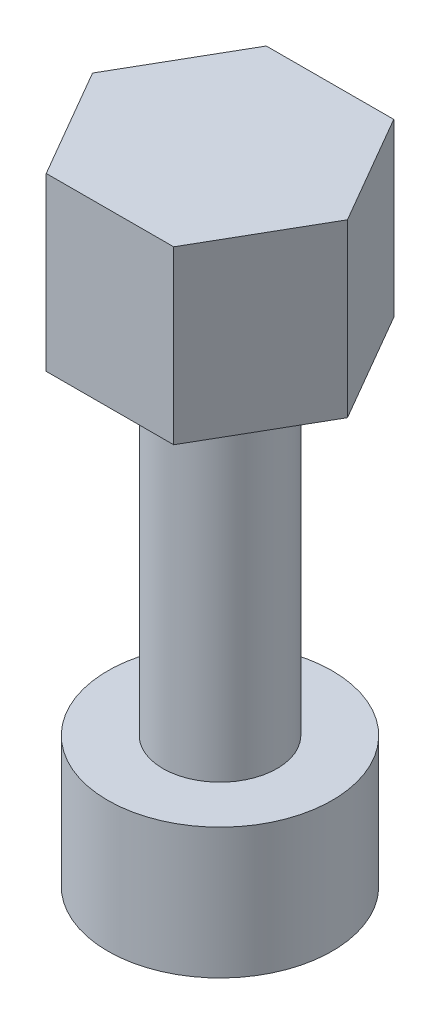
ISO-10303-21;
HEADER;
FILE_DESCRIPTION(('STEP AP214'),'2;1');
FILE_NAME('part.step','',(''),(''),'','','');
FILE_SCHEMA(('AUTOMOTIVE_DESIGN { 1 0 10303 214 1 1 1 1 }'));
ENDSEC;
DATA;
#1=APPLICATION_CONTEXT('core data for automotive mechanical design processes');
#2=APPLICATION_PROTOCOL_DEFINITION('international standard','automotive_design',2000,#1);
#3=PRODUCT_CONTEXT('',#1,'mechanical');
#4=PRODUCT('Part','Part','',(#3));
#5=PRODUCT_RELATED_PRODUCT_CATEGORY('part','',(#4));
#6=PRODUCT_DEFINITION_FORMATION('','',#4);
#7=PRODUCT_DEFINITION_CONTEXT('part definition',#1,'design');
#8=PRODUCT_DEFINITION('design','',#6,#7);
#9=PRODUCT_DEFINITION_SHAPE('','',#8);
#10=(LENGTH_UNIT() NAMED_UNIT(*) SI_UNIT(.MILLI.,.METRE.));
#11=(NAMED_UNIT(*) PLANE_ANGLE_UNIT() SI_UNIT($,.RADIAN.));
#12=(NAMED_UNIT(*) SI_UNIT($,.STERADIAN.) SOLID_ANGLE_UNIT());
#13=UNCERTAINTY_MEASURE_WITH_UNIT(LENGTH_MEASURE(1.E-05),#10,'distance_accuracy_value','');
#14=(GEOMETRIC_REPRESENTATION_CONTEXT(3) GLOBAL_UNCERTAINTY_ASSIGNED_CONTEXT((#13)) GLOBAL_UNIT_ASSIGNED_CONTEXT((#10,
#11,#12)) REPRESENTATION_CONTEXT('',''));
#15=CARTESIAN_POINT('',(0.,0.,0.));
#16=DIRECTION('',(0.,0.,1.));
#17=DIRECTION('',(1.,0.,0.));
#18=AXIS2_PLACEMENT_3D('',#15,#16,#17);
#19=CARTESIAN_POINT('',(0.,3.2,0.));
#20=DIRECTION('',(0.,-1.,0.));
#21=DIRECTION('',(0.,0.,-1.));
#22=AXIS2_PLACEMENT_3D('',#19,#20,#21);
#23=CYLINDRICAL_SURFACE('',#22,2.75);
#24=CARTESIAN_POINT('',(0.,3.2,0.));
#25=DIRECTION('',(0.,1.,0.));
#26=DIRECTION('',(0.,0.,1.));
#27=AXIS2_PLACEMENT_3D('',#24,#25,#26);
#28=CIRCLE('',#27,2.75);
#29=CARTESIAN_POINT('',(0.,3.2,2.75));
#30=VERTEX_POINT('',#29);
#31=EDGE_CURVE('E43',#30,#30,#28,.T.);
#32=ORIENTED_EDGE('',*,*,#31,.F.);
#33=EDGE_LOOP('',(#32));
#34=FACE_BOUND('',#33,.T.);
#35=CARTESIAN_POINT('',(0.,0.,0.));
#36=DIRECTION('',(0.,1.,0.));
#37=DIRECTION('',(0.,0.,1.));
#38=AXIS2_PLACEMENT_3D('',#35,#36,#37);
#39=CIRCLE('',#38,2.75);
#40=CARTESIAN_POINT('',(0.,0.,2.75));
#41=VERTEX_POINT('',#40);
#42=EDGE_CURVE('E37',#41,#41,#39,.T.);
#43=ORIENTED_EDGE('',*,*,#42,.T.);
#44=EDGE_LOOP('',(#43));
#45=FACE_BOUND('',#44,.T.);
#46=ADVANCED_FACE('F34',(#34,#45),#23,.T.);
#47=CARTESIAN_POINT('',(0.,3.2,0.));
#48=DIRECTION('',(0.,1.,0.));
#49=DIRECTION('',(0.,0.,1.));
#50=AXIS2_PLACEMENT_3D('',#47,#48,#49);
#51=PLANE('',#50);
#52=CARTESIAN_POINT('',(0.,3.2,0.));
#53=DIRECTION('',(0.,1.,0.));
#54=DIRECTION('',(0.,0.,1.));
#55=AXIS2_PLACEMENT_3D('',#52,#53,#54);
#56=CIRCLE('',#55,1.4);
#57=CARTESIAN_POINT('',(0.,3.2,1.4));
#58=VERTEX_POINT('',#57);
#59=EDGE_CURVE('E11',#58,#58,#56,.T.);
#60=ORIENTED_EDGE('',*,*,#59,.F.);
#61=EDGE_LOOP('',(#60));
#62=FACE_BOUND('',#61,.T.);
#63=ORIENTED_EDGE('',*,*,#31,.T.);
#64=EDGE_LOOP('',(#63));
#65=FACE_BOUND('',#64,.T.);
#66=ADVANCED_FACE('F152',(#62,#65),#51,.T.);
#67=CARTESIAN_POINT('',(0.,0.,0.));
#68=DIRECTION('',(0.,1.,0.));
#69=DIRECTION('',(0.,0.,1.));
#70=AXIS2_PLACEMENT_3D('',#67,#68,#69);
#71=PLANE('',#70);
#72=ORIENTED_EDGE('',*,*,#42,.F.);
#73=EDGE_LOOP('',(#72));
#74=FACE_BOUND('',#73,.T.);
#75=ADVANCED_FACE('F149',(#74),#71,.F.);
#76=CARTESIAN_POINT('',(0.,11.5,0.));
#77=DIRECTION('',(0.,-1.,0.));
#78=DIRECTION('',(0.,0.,-1.));
#79=AXIS2_PLACEMENT_3D('',#76,#77,#78);
#80=CYLINDRICAL_SURFACE('',#79,1.4);
#81=CARTESIAN_POINT('',(0.,11.5,0.));
#82=DIRECTION('',(0.,1.,0.));
#83=DIRECTION('',(0.,0.,1.));
#84=AXIS2_PLACEMENT_3D('',#81,#82,#83);
#85=CIRCLE('',#84,1.4);
#86=CARTESIAN_POINT('',(0.,11.5,1.4));
#87=VERTEX_POINT('',#86);
#88=EDGE_CURVE('E140',#87,#87,#85,.T.);
#89=ORIENTED_EDGE('',*,*,#88,.F.);
#90=EDGE_LOOP('',(#89));
#91=FACE_BOUND('',#90,.T.);
#92=ORIENTED_EDGE('',*,*,#59,.T.);
#93=EDGE_LOOP('',(#92));
#94=FACE_BOUND('',#93,.T.);
#95=ADVANCED_FACE('F151',(#91,#94),#80,.T.);
#96=CARTESIAN_POINT('',(3.11768769196028,15.7,-0.00484307747237343));
#97=DIRECTION('',(-0.865247649966082,0.,0.501344696020784));
#98=DIRECTION('',(0.501344696020784,0.,0.865247649966082));
#99=AXIS2_PLACEMENT_3D('',#96,#97,#98);
#100=PLANE('',#99);
#101=DIRECTION('',(-0.501344696020784,0.,-0.865247649966082));
#102=VECTOR('',#101,1.);
#103=CARTESIAN_POINT('',(3.11768769196028,11.5,-0.00484307747237343));
#104=LINE('',#103,#102);
#105=CARTESIAN_POINT('',(3.11768769196028,11.5,-0.00484307747237343));
#106=VERTEX_POINT('',#105);
#107=CARTESIAN_POINT('',(1.55464961785657,11.5,-2.70241828103986));
#108=VERTEX_POINT('',#107);
#109=EDGE_CURVE('E121',#106,#108,#104,.T.);
#110=ORIENTED_EDGE('',*,*,#109,.T.);
#111=DIRECTION('',(0.,-1.,0.));
#112=VECTOR('',#111,1.);
#113=CARTESIAN_POINT('',(1.55464961785657,15.7,-2.70241828103986));
#114=LINE('',#113,#112);
#115=CARTESIAN_POINT('',(1.55464961785657,15.7,-2.70241828103986));
#116=VERTEX_POINT('',#115);
#117=EDGE_CURVE('E138',#116,#108,#114,.T.);
#118=ORIENTED_EDGE('',*,*,#117,.F.);
#119=DIRECTION('',(-0.501344696020784,0.,-0.865247649966082));
#120=VECTOR('',#119,1.);
#121=CARTESIAN_POINT('',(3.11768769196028,15.7,-0.00484307747237343));
#122=LINE('',#121,#120);
#123=CARTESIAN_POINT('',(3.11768769196028,15.7,-0.00484307747237343));
#124=VERTEX_POINT('',#123);
#125=EDGE_CURVE('E131',#124,#116,#122,.T.);
#126=ORIENTED_EDGE('',*,*,#125,.F.);
#127=DIRECTION('',(0.,-1.,0.));
#128=VECTOR('',#127,1.);
#129=CARTESIAN_POINT('',(3.11768769196028,15.7,-0.00484307747237343));
#130=LINE('',#129,#128);
#131=EDGE_CURVE('E117',#124,#106,#130,.T.);
#132=ORIENTED_EDGE('',*,*,#131,.T.);
#133=EDGE_LOOP('',(#110,#118,#126,#132));
#134=FACE_BOUND('',#133,.T.);
#135=ADVANCED_FACE('F157',(#134),#100,.F.);
#136=CARTESIAN_POINT('',(1.55464961785657,15.7,-2.70241828103986));
#137=DIRECTION('',(0.0015534178235452,0.,0.999998793445805));
#138=DIRECTION('',(0.999998793445805,0.,-0.0015534178235452));
#139=AXIS2_PLACEMENT_3D('',#136,#137,#138);
#140=PLANE('',#139);
#141=DIRECTION('',(-0.999998793445805,0.,0.0015534178235452));
#142=VECTOR('',#141,1.);
#143=CARTESIAN_POINT('',(1.55464961785657,11.5,-2.70241828103986));
#144=LINE('',#143,#142);
#145=CARTESIAN_POINT('',(-1.56303807410371,11.5,-2.69757520356749));
#146=VERTEX_POINT('',#145);
#147=EDGE_CURVE('E124',#108,#146,#144,.T.);
#148=ORIENTED_EDGE('',*,*,#147,.T.);
#149=DIRECTION('',(0.,-1.,0.));
#150=VECTOR('',#149,1.);
#151=CARTESIAN_POINT('',(-1.56303807410371,15.7,-2.69757520356749));
#152=LINE('',#151,#150);
#153=CARTESIAN_POINT('',(-1.56303807410371,15.7,-2.69757520356749));
#154=VERTEX_POINT('',#153);
#155=EDGE_CURVE('E135',#154,#146,#152,.T.);
#156=ORIENTED_EDGE('',*,*,#155,.F.);
#157=DIRECTION('',(-0.999998793445805,0.,0.0015534178235452));
#158=VECTOR('',#157,1.);
#159=CARTESIAN_POINT('',(1.55464961785657,15.7,-2.70241828103986));
#160=LINE('',#159,#158);
#161=EDGE_CURVE('E90',#116,#154,#160,.T.);
#162=ORIENTED_EDGE('',*,*,#161,.F.);
#163=ORIENTED_EDGE('',*,*,#117,.T.);
#164=EDGE_LOOP('',(#148,#156,#162,#163));
#165=FACE_BOUND('',#164,.T.);
#166=ADVANCED_FACE('F187',(#165),#140,.F.);
#167=CARTESIAN_POINT('',(-1.56303807410371,15.7,-2.69757520356749));
#168=DIRECTION('',(0.866801067789627,0.,0.498654097425021));
#169=DIRECTION('',(0.498654097425021,0.,-0.866801067789627));
#170=AXIS2_PLACEMENT_3D('',#167,#168,#169);
#171=PLANE('',#170);
#172=DIRECTION('',(-0.498654097425021,0.,0.866801067789627));
#173=VECTOR('',#172,1.);
#174=CARTESIAN_POINT('',(-1.56303807410371,11.5,-2.69757520356749));
#175=LINE('',#174,#173);
#176=CARTESIAN_POINT('',(-3.11768769196028,11.5,0.00484307747237395));
#177=VERTEX_POINT('',#176);
#178=EDGE_CURVE('E126',#146,#177,#175,.T.);
#179=ORIENTED_EDGE('',*,*,#178,.T.);
#180=DIRECTION('',(0.,-1.,0.));
#181=VECTOR('',#180,1.);
#182=CARTESIAN_POINT('',(-3.11768769196028,15.7,0.00484307747237395));
#183=LINE('',#182,#181);
#184=CARTESIAN_POINT('',(-3.11768769196028,15.7,0.00484307747237395));
#185=VERTEX_POINT('',#184);
#186=EDGE_CURVE('E112',#185,#177,#183,.T.);
#187=ORIENTED_EDGE('',*,*,#186,.F.);
#188=DIRECTION('',(-0.498654097425021,0.,0.866801067789627));
#189=VECTOR('',#188,1.);
#190=CARTESIAN_POINT('',(-1.56303807410371,15.7,-2.69757520356749));
#191=LINE('',#190,#189);
#192=EDGE_CURVE('E103',#154,#185,#191,.T.);
#193=ORIENTED_EDGE('',*,*,#192,.F.);
#194=ORIENTED_EDGE('',*,*,#155,.T.);
#195=EDGE_LOOP('',(#179,#187,#193,#194));
#196=FACE_BOUND('',#195,.T.);
#197=ADVANCED_FACE('F197',(#196),#171,.F.);
#198=CARTESIAN_POINT('',(-3.11768769196028,15.7,0.00484307747237395));
#199=DIRECTION('',(0.865247649966082,0.,-0.501344696020784));
#200=DIRECTION('',(-0.501344696020784,0.,-0.865247649966082));
#201=AXIS2_PLACEMENT_3D('',#198,#199,#200);
#202=PLANE('',#201);
#203=DIRECTION('',(0.501344696020784,0.,0.865247649966082));
#204=VECTOR('',#203,1.);
#205=CARTESIAN_POINT('',(-3.11768769196028,11.5,0.00484307747237395));
#206=LINE('',#205,#204);
#207=CARTESIAN_POINT('',(-1.55464961785657,11.5,2.70241828103986));
#208=VERTEX_POINT('',#207);
#209=EDGE_CURVE('E111',#177,#208,#206,.T.);
#210=ORIENTED_EDGE('',*,*,#209,.T.);
#211=DIRECTION('',(0.,-1.,0.));
#212=VECTOR('',#211,1.);
#213=CARTESIAN_POINT('',(-1.55464961785657,15.7,2.70241828103986));
#214=LINE('',#213,#212);
#215=CARTESIAN_POINT('',(-1.55464961785657,15.7,2.70241828103986));
#216=VERTEX_POINT('',#215);
#217=EDGE_CURVE('E108',#216,#208,#214,.T.);
#218=ORIENTED_EDGE('',*,*,#217,.F.);
#219=DIRECTION('',(0.501344696020784,0.,0.865247649966082));
#220=VECTOR('',#219,1.);
#221=CARTESIAN_POINT('',(-3.11768769196028,15.7,0.00484307747237395));
#222=LINE('',#221,#220);
#223=EDGE_CURVE('E97',#185,#216,#222,.T.);
#224=ORIENTED_EDGE('',*,*,#223,.F.);
#225=ORIENTED_EDGE('',*,*,#186,.T.);
#226=EDGE_LOOP('',(#210,#218,#224,#225));
#227=FACE_BOUND('',#226,.T.);
#228=ADVANCED_FACE('F109',(#227),#202,.F.);
#229=CARTESIAN_POINT('',(-1.55464961785657,15.7,2.70241828103986));
#230=DIRECTION('',(-0.00155341782354492,0.,-0.999998793445805));
#231=DIRECTION('',(-0.999998793445805,0.,0.00155341782354492));
#232=AXIS2_PLACEMENT_3D('',#229,#230,#231);
#233=PLANE('',#232);
#234=DIRECTION('',(0.999998793445805,0.,-0.00155341782354492));
#235=VECTOR('',#234,1.);
#236=CARTESIAN_POINT('',(-1.55464961785657,11.5,2.70241828103986));
#237=LINE('',#236,#235);
#238=CARTESIAN_POINT('',(1.56303807410371,11.5,2.69757520356749));
#239=VERTEX_POINT('',#238);
#240=EDGE_CURVE('E75',#208,#239,#237,.T.);
#241=ORIENTED_EDGE('',*,*,#240,.T.);
#242=DIRECTION('',(0.,-1.,0.));
#243=VECTOR('',#242,1.);
#244=CARTESIAN_POINT('',(1.56303807410371,15.7,2.69757520356749));
#245=LINE('',#244,#243);
#246=CARTESIAN_POINT('',(1.56303807410371,15.7,2.69757520356749));
#247=VERTEX_POINT('',#246);
#248=EDGE_CURVE('E113',#247,#239,#245,.T.);
#249=ORIENTED_EDGE('',*,*,#248,.F.);
#250=DIRECTION('',(0.999998793445805,0.,-0.00155341782354492));
#251=VECTOR('',#250,1.);
#252=CARTESIAN_POINT('',(-1.55464961785657,15.7,2.70241828103986));
#253=LINE('',#252,#251);
#254=EDGE_CURVE('E101',#216,#247,#253,.T.);
#255=ORIENTED_EDGE('',*,*,#254,.F.);
#256=ORIENTED_EDGE('',*,*,#217,.T.);
#257=EDGE_LOOP('',(#241,#249,#255,#256));
#258=FACE_BOUND('',#257,.T.);
#259=ADVANCED_FACE('F115',(#258),#233,.F.);
#260=CARTESIAN_POINT('',(1.56303807410371,15.7,2.69757520356749));
#261=DIRECTION('',(-0.866801067789627,0.,-0.498654097425021));
#262=DIRECTION('',(-0.498654097425021,0.,0.866801067789627));
#263=AXIS2_PLACEMENT_3D('',#260,#261,#262);
#264=PLANE('',#263);
#265=DIRECTION('',(0.498654097425021,0.,-0.866801067789627));
#266=VECTOR('',#265,1.);
#267=CARTESIAN_POINT('',(1.56303807410371,11.5,2.69757520356749));
#268=LINE('',#267,#266);
#269=EDGE_CURVE('E81',#239,#106,#268,.T.);
#270=ORIENTED_EDGE('',*,*,#269,.T.);
#271=ORIENTED_EDGE('',*,*,#131,.F.);
#272=DIRECTION('',(0.498654097425021,0.,-0.866801067789627));
#273=VECTOR('',#272,1.);
#274=CARTESIAN_POINT('',(1.56303807410371,15.7,2.69757520356749));
#275=LINE('',#274,#273);
#276=EDGE_CURVE('E52',#247,#124,#275,.T.);
#277=ORIENTED_EDGE('',*,*,#276,.F.);
#278=ORIENTED_EDGE('',*,*,#248,.T.);
#279=EDGE_LOOP('',(#270,#271,#277,#278));
#280=FACE_BOUND('',#279,.T.);
#281=ADVANCED_FACE('F223',(#280),#264,.F.);
#282=CARTESIAN_POINT('',(0.,15.7,0.));
#283=DIRECTION('',(0.,1.,0.));
#284=DIRECTION('',(0.,0.,1.));
#285=AXIS2_PLACEMENT_3D('',#282,#283,#284);
#286=PLANE('',#285);
#287=ORIENTED_EDGE('',*,*,#125,.T.);
#288=ORIENTED_EDGE('',*,*,#161,.T.);
#289=ORIENTED_EDGE('',*,*,#192,.T.);
#290=ORIENTED_EDGE('',*,*,#223,.T.);
#291=ORIENTED_EDGE('',*,*,#254,.T.);
#292=ORIENTED_EDGE('',*,*,#276,.T.);
#293=EDGE_LOOP('',(#287,#288,#289,#290,#291,#292));
#294=FACE_BOUND('',#293,.T.);
#295=ADVANCED_FACE('F99',(#294),#286,.T.);
#296=CARTESIAN_POINT('',(0.,11.5,0.));
#297=DIRECTION('',(0.,1.,0.));
#298=DIRECTION('',(0.,0.,1.));
#299=AXIS2_PLACEMENT_3D('',#296,#297,#298);
#300=PLANE('',#299);
#301=ORIENTED_EDGE('',*,*,#88,.T.);
#302=EDGE_LOOP('',(#301));
#303=FACE_BOUND('',#302,.T.);
#304=ORIENTED_EDGE('',*,*,#109,.F.);
#305=ORIENTED_EDGE('',*,*,#269,.F.);
#306=ORIENTED_EDGE('',*,*,#240,.F.);
#307=ORIENTED_EDGE('',*,*,#209,.F.);
#308=ORIENTED_EDGE('',*,*,#178,.F.);
#309=ORIENTED_EDGE('',*,*,#147,.F.);
#310=EDGE_LOOP('',(#304,#305,#306,#307,#308,#309));
#311=FACE_BOUND('',#310,.T.);
#312=ADVANCED_FACE('F240',(#303,#311),#300,.F.);
#313=CLOSED_SHELL('',(#46,#66,#75,#95,#135,#166,#197,#228,#259,#281,#295,#312));
#314=MANIFOLD_SOLID_BREP('B2',#313);
#315=ADVANCED_BREP_SHAPE_REPRESENTATION('',(#18,#314),#14);
#316=SHAPE_DEFINITION_REPRESENTATION(#9,#315);
ENDSEC;
END-ISO-10303-21;
